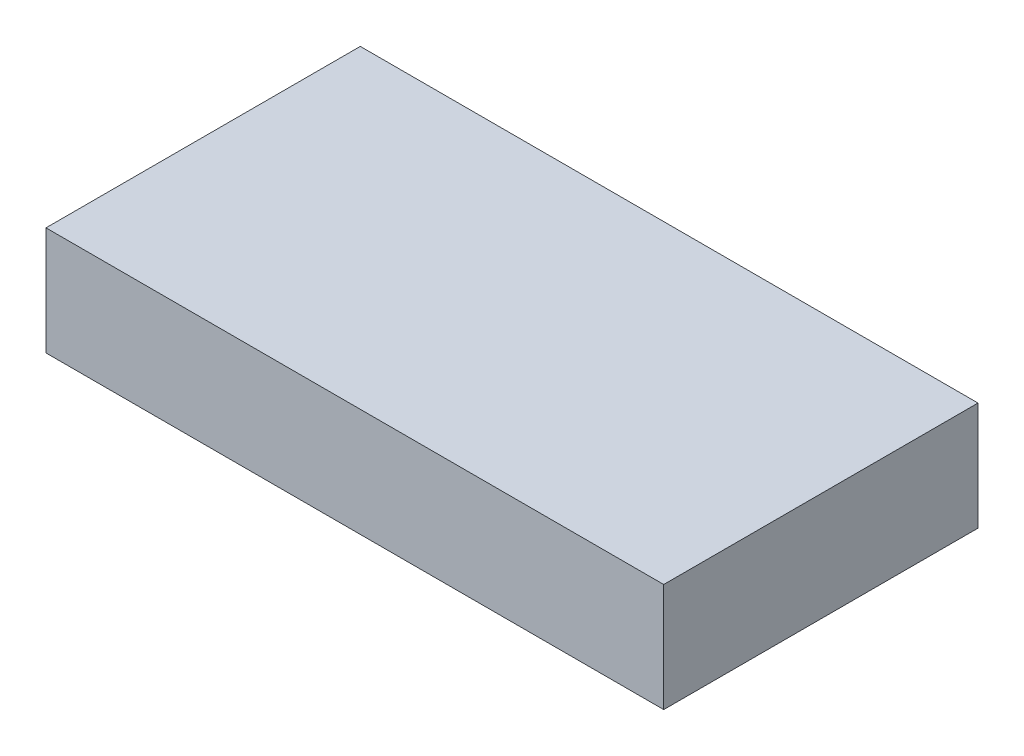
ISO-10303-21;
HEADER;
FILE_DESCRIPTION(('STEP AP214'),'2;1');
FILE_NAME('part.step','',(''),(''),'','','');
FILE_SCHEMA(('AUTOMOTIVE_DESIGN { 1 0 10303 214 1 1 1 1 }'));
ENDSEC;
DATA;
#1=APPLICATION_CONTEXT('core data for automotive mechanical design processes');
#2=APPLICATION_PROTOCOL_DEFINITION('international standard','automotive_design',2000,#1);
#3=PRODUCT_CONTEXT('',#1,'mechanical');
#4=PRODUCT('Part','Part','',(#3));
#5=PRODUCT_RELATED_PRODUCT_CATEGORY('part','',(#4));
#6=PRODUCT_DEFINITION_FORMATION('','',#4);
#7=PRODUCT_DEFINITION_CONTEXT('part definition',#1,'design');
#8=PRODUCT_DEFINITION('design','',#6,#7);
#9=PRODUCT_DEFINITION_SHAPE('','',#8);
#10=(LENGTH_UNIT() NAMED_UNIT(*) SI_UNIT(.MILLI.,.METRE.));
#11=(NAMED_UNIT(*) PLANE_ANGLE_UNIT() SI_UNIT($,.RADIAN.));
#12=(NAMED_UNIT(*) SI_UNIT($,.STERADIAN.) SOLID_ANGLE_UNIT());
#13=UNCERTAINTY_MEASURE_WITH_UNIT(LENGTH_MEASURE(1.E-05),#10,'distance_accuracy_value','');
#14=(GEOMETRIC_REPRESENTATION_CONTEXT(3) GLOBAL_UNCERTAINTY_ASSIGNED_CONTEXT((#13)) GLOBAL_UNIT_ASSIGNED_CONTEXT((#10,
#11,#12)) REPRESENTATION_CONTEXT('',''));
#15=CARTESIAN_POINT('',(0.,0.,0.));
#16=DIRECTION('',(0.,0.,1.));
#17=DIRECTION('',(1.,0.,0.));
#18=AXIS2_PLACEMENT_3D('',#15,#16,#17);
#19=CARTESIAN_POINT('',(0.,10.,0.));
#20=DIRECTION('',(1.,0.,0.));
#21=DIRECTION('',(0.,0.,-1.));
#22=AXIS2_PLACEMENT_3D('',#19,#20,#21);
#23=PLANE('',#22);
#24=DIRECTION('',(0.,0.,1.));
#25=VECTOR('',#24,1.);
#26=CARTESIAN_POINT('',(0.,0.,0.));
#27=LINE('',#26,#25);
#28=CARTESIAN_POINT('',(0.,0.,-29.));
#29=VERTEX_POINT('',#28);
#30=CARTESIAN_POINT('',(0.,0.,0.));
#31=VERTEX_POINT('',#30);
#32=EDGE_CURVE('E100',#29,#31,#27,.T.);
#33=ORIENTED_EDGE('',*,*,#32,.T.);
#34=DIRECTION('',(0.,-1.,0.));
#35=VECTOR('',#34,1.);
#36=CARTESIAN_POINT('',(0.,10.,0.));
#37=LINE('',#36,#35);
#38=CARTESIAN_POINT('',(0.,10.,0.));
#39=VERTEX_POINT('',#38);
#40=EDGE_CURVE('E11',#39,#31,#37,.T.);
#41=ORIENTED_EDGE('',*,*,#40,.F.);
#42=DIRECTION('',(0.,0.,1.));
#43=VECTOR('',#42,1.);
#44=CARTESIAN_POINT('',(0.,10.,0.));
#45=LINE('',#44,#43);
#46=CARTESIAN_POINT('',(0.,10.,-29.));
#47=VERTEX_POINT('',#46);
#48=EDGE_CURVE('E88',#47,#39,#45,.T.);
#49=ORIENTED_EDGE('',*,*,#48,.F.);
#50=DIRECTION('',(0.,-1.,0.));
#51=VECTOR('',#50,1.);
#52=CARTESIAN_POINT('',(0.,10.,-29.));
#53=LINE('',#52,#51);
#54=EDGE_CURVE('E96',#47,#29,#53,.T.);
#55=ORIENTED_EDGE('',*,*,#54,.T.);
#56=EDGE_LOOP('',(#33,#41,#49,#55));
#57=FACE_BOUND('',#56,.T.);
#58=ADVANCED_FACE('F37',(#57),#23,.F.);
#59=CARTESIAN_POINT('',(0.,10.,0.));
#60=DIRECTION('',(0.,0.,-1.));
#61=DIRECTION('',(-1.,0.,0.));
#62=AXIS2_PLACEMENT_3D('',#59,#60,#61);
#63=PLANE('',#62);
#64=DIRECTION('',(1.,0.,0.));
#65=VECTOR('',#64,1.);
#66=CARTESIAN_POINT('',(0.,0.,0.));
#67=LINE('',#66,#65);
#68=CARTESIAN_POINT('',(57.,0.,0.));
#69=VERTEX_POINT('',#68);
#70=EDGE_CURVE('E92',#31,#69,#67,.T.);
#71=ORIENTED_EDGE('',*,*,#70,.T.);
#72=DIRECTION('',(0.,-1.,0.));
#73=VECTOR('',#72,1.);
#74=CARTESIAN_POINT('',(57.,10.,0.));
#75=LINE('',#74,#73);
#76=CARTESIAN_POINT('',(57.,10.,0.));
#77=VERTEX_POINT('',#76);
#78=EDGE_CURVE('E45',#77,#69,#75,.T.);
#79=ORIENTED_EDGE('',*,*,#78,.F.);
#80=DIRECTION('',(1.,0.,0.));
#81=VECTOR('',#80,1.);
#82=CARTESIAN_POINT('',(0.,10.,0.));
#83=LINE('',#82,#81);
#84=EDGE_CURVE('E83',#39,#77,#83,.T.);
#85=ORIENTED_EDGE('',*,*,#84,.F.);
#86=ORIENTED_EDGE('',*,*,#40,.T.);
#87=EDGE_LOOP('',(#71,#79,#85,#86));
#88=FACE_BOUND('',#87,.T.);
#89=ADVANCED_FACE('F91',(#88),#63,.F.);
#90=CARTESIAN_POINT('',(57.,10.,0.));
#91=DIRECTION('',(-1.,0.,0.));
#92=DIRECTION('',(0.,0.,1.));
#93=AXIS2_PLACEMENT_3D('',#90,#91,#92);
#94=PLANE('',#93);
#95=DIRECTION('',(0.,0.,-1.));
#96=VECTOR('',#95,1.);
#97=CARTESIAN_POINT('',(57.,0.,0.));
#98=LINE('',#97,#96);
#99=CARTESIAN_POINT('',(57.,0.,-29.));
#100=VERTEX_POINT('',#99);
#101=EDGE_CURVE('E70',#69,#100,#98,.T.);
#102=ORIENTED_EDGE('',*,*,#101,.T.);
#103=DIRECTION('',(0.,-1.,0.));
#104=VECTOR('',#103,1.);
#105=CARTESIAN_POINT('',(57.,10.,-29.));
#106=LINE('',#105,#104);
#107=CARTESIAN_POINT('',(57.,10.,-29.));
#108=VERTEX_POINT('',#107);
#109=EDGE_CURVE('E93',#108,#100,#106,.T.);
#110=ORIENTED_EDGE('',*,*,#109,.F.);
#111=DIRECTION('',(0.,0.,-1.));
#112=VECTOR('',#111,1.);
#113=CARTESIAN_POINT('',(57.,10.,0.));
#114=LINE('',#113,#112);
#115=EDGE_CURVE('E86',#77,#108,#114,.T.);
#116=ORIENTED_EDGE('',*,*,#115,.F.);
#117=ORIENTED_EDGE('',*,*,#78,.T.);
#118=EDGE_LOOP('',(#102,#110,#116,#117));
#119=FACE_BOUND('',#118,.T.);
#120=ADVANCED_FACE('F94',(#119),#94,.F.);
#121=CARTESIAN_POINT('',(0.,10.,-29.));
#122=DIRECTION('',(0.,0.,1.));
#123=DIRECTION('',(1.,0.,0.));
#124=AXIS2_PLACEMENT_3D('',#121,#122,#123);
#125=PLANE('',#124);
#126=DIRECTION('',(-1.,0.,0.));
#127=VECTOR('',#126,1.);
#128=CARTESIAN_POINT('',(0.,0.,-29.));
#129=LINE('',#128,#127);
#130=EDGE_CURVE('E76',#100,#29,#129,.T.);
#131=ORIENTED_EDGE('',*,*,#130,.T.);
#132=ORIENTED_EDGE('',*,*,#54,.F.);
#133=DIRECTION('',(-1.,0.,0.));
#134=VECTOR('',#133,1.);
#135=CARTESIAN_POINT('',(0.,10.,-29.));
#136=LINE('',#135,#134);
#137=EDGE_CURVE('E53',#108,#47,#136,.T.);
#138=ORIENTED_EDGE('',*,*,#137,.F.);
#139=ORIENTED_EDGE('',*,*,#109,.T.);
#140=EDGE_LOOP('',(#131,#132,#138,#139));
#141=FACE_BOUND('',#140,.T.);
#142=ADVANCED_FACE('F107',(#141),#125,.F.);
#143=CARTESIAN_POINT('',(0.,10.,0.));
#144=DIRECTION('',(0.,-1.,0.));
#145=DIRECTION('',(0.,0.,-1.));
#146=AXIS2_PLACEMENT_3D('',#143,#144,#145);
#147=PLANE('',#146);
#148=ORIENTED_EDGE('',*,*,#48,.T.);
#149=ORIENTED_EDGE('',*,*,#84,.T.);
#150=ORIENTED_EDGE('',*,*,#115,.T.);
#151=ORIENTED_EDGE('',*,*,#137,.T.);
#152=EDGE_LOOP('',(#148,#149,#150,#151));
#153=FACE_BOUND('',#152,.T.);
#154=ADVANCED_FACE('F84',(#153),#147,.F.);
#155=CARTESIAN_POINT('',(0.,0.,0.));
#156=DIRECTION('',(0.,-1.,0.));
#157=DIRECTION('',(0.,0.,-1.));
#158=AXIS2_PLACEMENT_3D('',#155,#156,#157);
#159=PLANE('',#158);
#160=ORIENTED_EDGE('',*,*,#32,.F.);
#161=ORIENTED_EDGE('',*,*,#130,.F.);
#162=ORIENTED_EDGE('',*,*,#101,.F.);
#163=ORIENTED_EDGE('',*,*,#70,.F.);
#164=EDGE_LOOP('',(#160,#161,#162,#163));
#165=FACE_BOUND('',#164,.T.);
#166=ADVANCED_FACE('F110',(#165),#159,.T.);
#167=CLOSED_SHELL('',(#58,#89,#120,#142,#154,#166));
#168=MANIFOLD_SOLID_BREP('B2',#167);
#169=ADVANCED_BREP_SHAPE_REPRESENTATION('',(#18,#168),#14);
#170=SHAPE_DEFINITION_REPRESENTATION(#9,#169);
ENDSEC;
END-ISO-10303-21;
